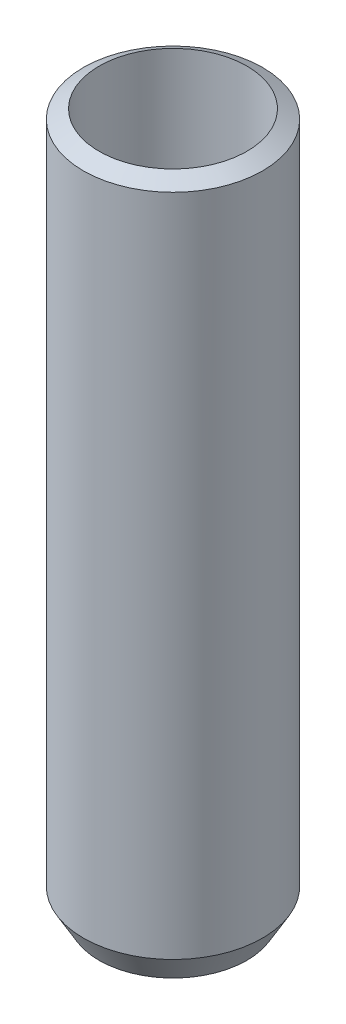
ISO-10303-21;
HEADER;
FILE_DESCRIPTION(('STEP AP214'),'2;1');
FILE_NAME('part.step','',(''),(''),'','','');
FILE_SCHEMA(('AUTOMOTIVE_DESIGN { 1 0 10303 214 1 1 1 1 }'));
ENDSEC;
DATA;
#1=APPLICATION_CONTEXT('core data for automotive mechanical design processes');
#2=APPLICATION_PROTOCOL_DEFINITION('international standard','automotive_design',2000,#1);
#3=PRODUCT_CONTEXT('',#1,'mechanical');
#4=PRODUCT('Part','Part','',(#3));
#5=PRODUCT_RELATED_PRODUCT_CATEGORY('part','',(#4));
#6=PRODUCT_DEFINITION_FORMATION('','',#4);
#7=PRODUCT_DEFINITION_CONTEXT('part definition',#1,'design');
#8=PRODUCT_DEFINITION('design','',#6,#7);
#9=PRODUCT_DEFINITION_SHAPE('','',#8);
#10=(LENGTH_UNIT() NAMED_UNIT(*) SI_UNIT(.MILLI.,.METRE.));
#11=(NAMED_UNIT(*) PLANE_ANGLE_UNIT() SI_UNIT($,.RADIAN.));
#12=(NAMED_UNIT(*) SI_UNIT($,.STERADIAN.) SOLID_ANGLE_UNIT());
#13=UNCERTAINTY_MEASURE_WITH_UNIT(LENGTH_MEASURE(1.E-05),#10,'distance_accuracy_value','');
#14=(GEOMETRIC_REPRESENTATION_CONTEXT(3) GLOBAL_UNCERTAINTY_ASSIGNED_CONTEXT((#13)) GLOBAL_UNIT_ASSIGNED_CONTEXT((#10,
#11,#12)) REPRESENTATION_CONTEXT('',''));
#15=CARTESIAN_POINT('',(0.,0.,0.));
#16=DIRECTION('',(0.,0.,1.));
#17=DIRECTION('',(1.,0.,0.));
#18=AXIS2_PLACEMENT_3D('',#15,#16,#17);
#19=CARTESIAN_POINT('',(0.,198.941748339923,0.));
#20=DIRECTION('',(0.,-1.,0.));
#21=DIRECTION('',(0.,0.,-1.));
#22=AXIS2_PLACEMENT_3D('',#19,#20,#21);
#23=CYLINDRICAL_SURFACE('',#22,25.);
#24=CARTESIAN_POINT('',(0.,193.98221372547,0.));
#25=DIRECTION('',(0.,1.,0.));
#26=DIRECTION('',(0.,0.,1.));
#27=AXIS2_PLACEMENT_3D('',#24,#25,#26);
#28=CIRCLE('',#27,25.);
#29=CARTESIAN_POINT('',(0.,193.98221372547,25.));
#30=VERTEX_POINT('',#29);
#31=EDGE_CURVE('E10',#30,#30,#28,.F.);
#32=ORIENTED_EDGE('',*,*,#31,.T.);
#33=EDGE_LOOP('',(#32));
#34=FACE_BOUND('',#33,.T.);
#35=CARTESIAN_POINT('',(0.,8.59016593412776,0.));
#36=DIRECTION('',(0.,1.,0.));
#37=DIRECTION('',(0.,0.,1.));
#38=AXIS2_PLACEMENT_3D('',#35,#36,#37);
#39=CIRCLE('',#38,25.);
#40=CARTESIAN_POINT('',(0.,8.59016593412776,25.));
#41=VERTEX_POINT('',#40);
#42=EDGE_CURVE('E50',#41,#41,#39,.T.);
#43=ORIENTED_EDGE('',*,*,#42,.T.);
#44=EDGE_LOOP('',(#43));
#45=FACE_BOUND('',#44,.T.);
#46=ADVANCED_FACE('F39',(#34,#45),#23,.T.);
#47=CARTESIAN_POINT('',(0.,198.941748339923,0.));
#48=DIRECTION('',(0.,-1.,0.));
#49=DIRECTION('',(0.,0.,-1.));
#50=AXIS2_PLACEMENT_3D('',#47,#48,#49);
#51=CYLINDRICAL_SURFACE('',#50,20.6207474341481);
#52=CARTESIAN_POINT('',(0.,196.510576373214,0.));
#53=DIRECTION('',(0.,-1.,0.));
#54=DIRECTION('',(0.,0.,-1.));
#55=AXIS2_PLACEMENT_3D('',#52,#53,#54);
#56=CIRCLE('',#55,20.6207474341481);
#57=CARTESIAN_POINT('',(0.,196.510576373214,-20.6207474341481));
#58=VERTEX_POINT('',#57);
#59=EDGE_CURVE('E51',#58,#58,#56,.F.);
#60=ORIENTED_EDGE('',*,*,#59,.T.);
#61=EDGE_LOOP('',(#60));
#62=FACE_BOUND('',#61,.T.);
#63=CARTESIAN_POINT('',(0.,1.0050779908959,0.));
#64=DIRECTION('',(0.,1.,0.));
#65=DIRECTION('',(0.,0.,1.));
#66=AXIS2_PLACEMENT_3D('',#63,#64,#65);
#67=CIRCLE('',#66,20.6207474341481);
#68=CARTESIAN_POINT('',(0.,1.0050779908959,20.6207474341481));
#69=VERTEX_POINT('',#68);
#70=EDGE_CURVE('E54',#69,#69,#67,.F.);
#71=ORIENTED_EDGE('',*,*,#70,.T.);
#72=EDGE_LOOP('',(#71));
#73=FACE_BOUND('',#72,.T.);
#74=ADVANCED_FACE('F63',(#62,#73),#51,.F.);
#75=CARTESIAN_POINT('',(0.,198.941748339923,0.));
#76=DIRECTION('',(0.,-1.,0.));
#77=DIRECTION('',(0.,0.,-1.));
#78=AXIS2_PLACEMENT_3D('',#75,#76,#77);
#79=CONICAL_SURFACE('',#78,16.4098340658722,1.0471975511966);
#80=ORIENTED_EDGE('',*,*,#31,.F.);
#81=EDGE_LOOP('',(#80));
#82=FACE_BOUND('',#81,.T.);
#83=ORIENTED_EDGE('',*,*,#59,.F.);
#84=EDGE_LOOP('',(#83));
#85=FACE_BOUND('',#84,.T.);
#86=ADVANCED_FACE('F64',(#82,#85),#79,.T.);
#87=CARTESIAN_POINT('',(0.,8.59016593412776,0.));
#88=DIRECTION('',(0.,1.,0.));
#89=DIRECTION('',(0.,0.,1.));
#90=AXIS2_PLACEMENT_3D('',#87,#88,#89);
#91=CONICAL_SURFACE('',#90,25.,0.523598775598298);
#92=ORIENTED_EDGE('',*,*,#70,.F.);
#93=EDGE_LOOP('',(#92));
#94=FACE_BOUND('',#93,.T.);
#95=ORIENTED_EDGE('',*,*,#42,.F.);
#96=EDGE_LOOP('',(#95));
#97=FACE_BOUND('',#96,.T.);
#98=ADVANCED_FACE('F45',(#94,#97),#91,.T.);
#99=CLOSED_SHELL('',(#46,#74,#86,#98));
#100=MANIFOLD_SOLID_BREP('B2',#99);
#101=ADVANCED_BREP_SHAPE_REPRESENTATION('',(#18,#100),#14);
#102=SHAPE_DEFINITION_REPRESENTATION(#9,#101);
ENDSEC;
END-ISO-10303-21;
